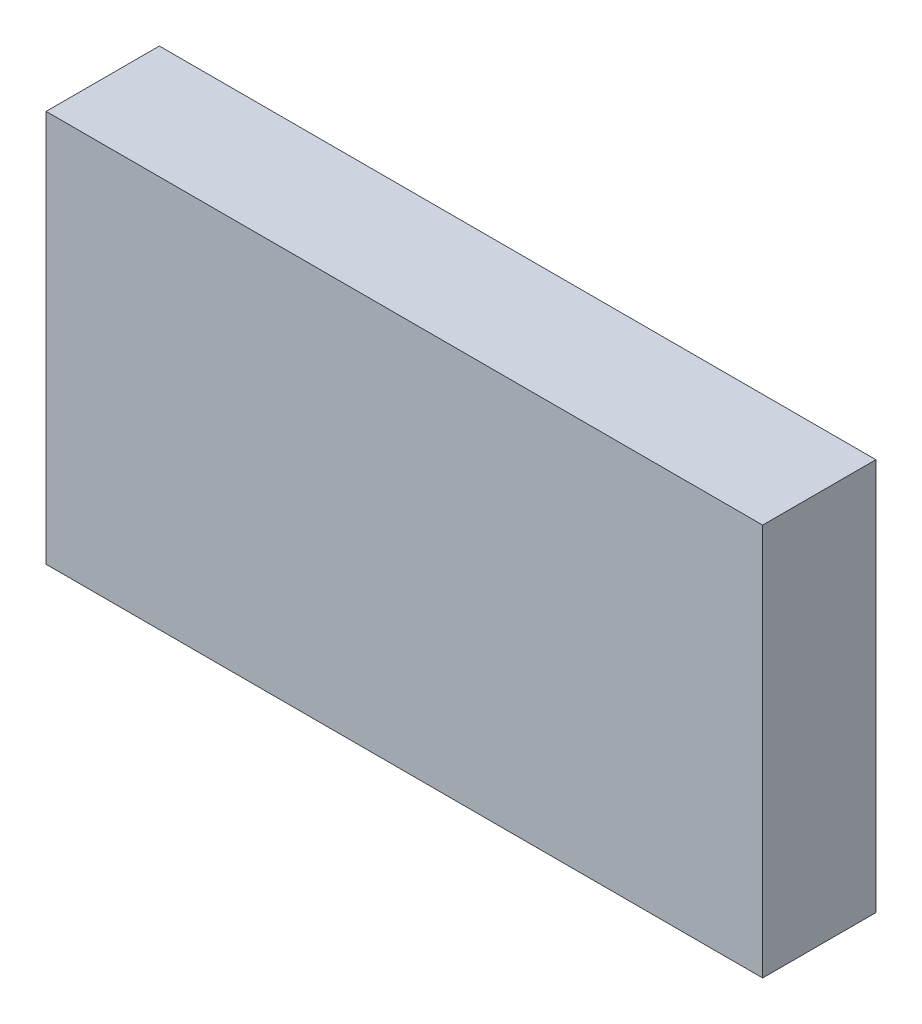
ISO-10303-21;
HEADER;
FILE_DESCRIPTION(('STEP AP214'),'2;1');
FILE_NAME('part.step','',(''),(''),'','','');
FILE_SCHEMA(('AUTOMOTIVE_DESIGN { 1 0 10303 214 1 1 1 1 }'));
ENDSEC;
DATA;
#1=APPLICATION_CONTEXT('core data for automotive mechanical design processes');
#2=APPLICATION_PROTOCOL_DEFINITION('international standard','automotive_design',2000,#1);
#3=PRODUCT_CONTEXT('',#1,'mechanical');
#4=PRODUCT('Part','Part','',(#3));
#5=PRODUCT_RELATED_PRODUCT_CATEGORY('part','',(#4));
#6=PRODUCT_DEFINITION_FORMATION('','',#4);
#7=PRODUCT_DEFINITION_CONTEXT('part definition',#1,'design');
#8=PRODUCT_DEFINITION('design','',#6,#7);
#9=PRODUCT_DEFINITION_SHAPE('','',#8);
#10=(LENGTH_UNIT() NAMED_UNIT(*) SI_UNIT(.MILLI.,.METRE.));
#11=(NAMED_UNIT(*) PLANE_ANGLE_UNIT() SI_UNIT($,.RADIAN.));
#12=(NAMED_UNIT(*) SI_UNIT($,.STERADIAN.) SOLID_ANGLE_UNIT());
#13=UNCERTAINTY_MEASURE_WITH_UNIT(LENGTH_MEASURE(1.E-05),#10,'distance_accuracy_value','');
#14=(GEOMETRIC_REPRESENTATION_CONTEXT(3) GLOBAL_UNCERTAINTY_ASSIGNED_CONTEXT((#13)) GLOBAL_UNIT_ASSIGNED_CONTEXT((#10,
#11,#12)) REPRESENTATION_CONTEXT('',''));
#15=CARTESIAN_POINT('',(0.,0.,0.));
#16=DIRECTION('',(0.,0.,1.));
#17=DIRECTION('',(1.,0.,0.));
#18=AXIS2_PLACEMENT_3D('',#15,#16,#17);
#19=CARTESIAN_POINT('',(-3.1635,-1.7,1.));
#20=DIRECTION('',(1.,0.,0.));
#21=DIRECTION('',(0.,0.,-1.));
#22=AXIS2_PLACEMENT_3D('',#19,#20,#21);
#23=PLANE('',#22);
#24=DIRECTION('',(0.,-1.,0.));
#25=VECTOR('',#24,1.);
#26=CARTESIAN_POINT('',(-3.1635,-1.7,0.));
#27=LINE('',#26,#25);
#28=CARTESIAN_POINT('',(-3.1635,1.7635,0.));
#29=VERTEX_POINT('',#28);
#30=CARTESIAN_POINT('',(-3.1635,-1.7,0.));
#31=VERTEX_POINT('',#30);
#32=EDGE_CURVE('E95',#29,#31,#27,.T.);
#33=ORIENTED_EDGE('',*,*,#32,.T.);
#34=DIRECTION('',(0.,0.,-1.));
#35=VECTOR('',#34,1.);
#36=CARTESIAN_POINT('',(-3.1635,-1.7,1.));
#37=LINE('',#36,#35);
#38=CARTESIAN_POINT('',(-3.1635,-1.7,1.));
#39=VERTEX_POINT('',#38);
#40=EDGE_CURVE('E11',#39,#31,#37,.T.);
#41=ORIENTED_EDGE('',*,*,#40,.F.);
#42=DIRECTION('',(0.,-1.,0.));
#43=VECTOR('',#42,1.);
#44=CARTESIAN_POINT('',(-3.1635,-1.7,1.));
#45=LINE('',#44,#43);
#46=CARTESIAN_POINT('',(-3.1635,1.7635,1.));
#47=VERTEX_POINT('',#46);
#48=EDGE_CURVE('E83',#47,#39,#45,.T.);
#49=ORIENTED_EDGE('',*,*,#48,.F.);
#50=DIRECTION('',(0.,0.,-1.));
#51=VECTOR('',#50,1.);
#52=CARTESIAN_POINT('',(-3.1635,1.7635,1.));
#53=LINE('',#52,#51);
#54=EDGE_CURVE('E91',#47,#29,#53,.T.);
#55=ORIENTED_EDGE('',*,*,#54,.T.);
#56=EDGE_LOOP('',(#33,#41,#49,#55));
#57=FACE_BOUND('',#56,.T.);
#58=ADVANCED_FACE('F32',(#57),#23,.F.);
#59=CARTESIAN_POINT('',(3.1635,-1.7,1.));
#60=DIRECTION('',(0.,1.,0.));
#61=DIRECTION('',(0.,0.,1.));
#62=AXIS2_PLACEMENT_3D('',#59,#60,#61);
#63=PLANE('',#62);
#64=DIRECTION('',(1.,0.,0.));
#65=VECTOR('',#64,1.);
#66=CARTESIAN_POINT('',(3.1635,-1.7,0.));
#67=LINE('',#66,#65);
#68=CARTESIAN_POINT('',(3.1635,-1.7,0.));
#69=VERTEX_POINT('',#68);
#70=EDGE_CURVE('E87',#31,#69,#67,.T.);
#71=ORIENTED_EDGE('',*,*,#70,.T.);
#72=DIRECTION('',(0.,0.,-1.));
#73=VECTOR('',#72,1.);
#74=CARTESIAN_POINT('',(3.1635,-1.7,1.));
#75=LINE('',#74,#73);
#76=CARTESIAN_POINT('',(3.1635,-1.7,1.));
#77=VERTEX_POINT('',#76);
#78=EDGE_CURVE('E40',#77,#69,#75,.T.);
#79=ORIENTED_EDGE('',*,*,#78,.F.);
#80=DIRECTION('',(1.,0.,0.));
#81=VECTOR('',#80,1.);
#82=CARTESIAN_POINT('',(3.1635,-1.7,1.));
#83=LINE('',#82,#81);
#84=EDGE_CURVE('E78',#39,#77,#83,.T.);
#85=ORIENTED_EDGE('',*,*,#84,.F.);
#86=ORIENTED_EDGE('',*,*,#40,.T.);
#87=EDGE_LOOP('',(#71,#79,#85,#86));
#88=FACE_BOUND('',#87,.T.);
#89=ADVANCED_FACE('F86',(#88),#63,.F.);
#90=CARTESIAN_POINT('',(3.1635,1.7635,1.));
#91=DIRECTION('',(-1.,0.,0.));
#92=DIRECTION('',(0.,0.,1.));
#93=AXIS2_PLACEMENT_3D('',#90,#91,#92);
#94=PLANE('',#93);
#95=DIRECTION('',(0.,1.,0.));
#96=VECTOR('',#95,1.);
#97=CARTESIAN_POINT('',(3.1635,1.7635,0.));
#98=LINE('',#97,#96);
#99=CARTESIAN_POINT('',(3.1635,1.7635,0.));
#100=VERTEX_POINT('',#99);
#101=EDGE_CURVE('E65',#69,#100,#98,.T.);
#102=ORIENTED_EDGE('',*,*,#101,.T.);
#103=DIRECTION('',(0.,0.,-1.));
#104=VECTOR('',#103,1.);
#105=CARTESIAN_POINT('',(3.1635,1.7635,1.));
#106=LINE('',#105,#104);
#107=CARTESIAN_POINT('',(3.1635,1.7635,1.));
#108=VERTEX_POINT('',#107);
#109=EDGE_CURVE('E88',#108,#100,#106,.T.);
#110=ORIENTED_EDGE('',*,*,#109,.F.);
#111=DIRECTION('',(0.,1.,0.));
#112=VECTOR('',#111,1.);
#113=CARTESIAN_POINT('',(3.1635,1.7635,1.));
#114=LINE('',#113,#112);
#115=EDGE_CURVE('E81',#77,#108,#114,.T.);
#116=ORIENTED_EDGE('',*,*,#115,.F.);
#117=ORIENTED_EDGE('',*,*,#78,.T.);
#118=EDGE_LOOP('',(#102,#110,#116,#117));
#119=FACE_BOUND('',#118,.T.);
#120=ADVANCED_FACE('F89',(#119),#94,.F.);
#121=CARTESIAN_POINT('',(-3.1635,1.7635,1.));
#122=DIRECTION('',(0.,-1.,0.));
#123=DIRECTION('',(0.,0.,-1.));
#124=AXIS2_PLACEMENT_3D('',#121,#122,#123);
#125=PLANE('',#124);
#126=DIRECTION('',(-1.,0.,0.));
#127=VECTOR('',#126,1.);
#128=CARTESIAN_POINT('',(-3.1635,1.7635,0.));
#129=LINE('',#128,#127);
#130=EDGE_CURVE('E71',#100,#29,#129,.T.);
#131=ORIENTED_EDGE('',*,*,#130,.T.);
#132=ORIENTED_EDGE('',*,*,#54,.F.);
#133=DIRECTION('',(-1.,0.,0.));
#134=VECTOR('',#133,1.);
#135=CARTESIAN_POINT('',(-3.1635,1.7635,1.));
#136=LINE('',#135,#134);
#137=EDGE_CURVE('E48',#108,#47,#136,.T.);
#138=ORIENTED_EDGE('',*,*,#137,.F.);
#139=ORIENTED_EDGE('',*,*,#109,.T.);
#140=EDGE_LOOP('',(#131,#132,#138,#139));
#141=FACE_BOUND('',#140,.T.);
#142=ADVANCED_FACE('F102',(#141),#125,.F.);
#143=CARTESIAN_POINT('',(0.,0.,1.));
#144=DIRECTION('',(0.,0.,-1.));
#145=DIRECTION('',(-1.,0.,0.));
#146=AXIS2_PLACEMENT_3D('',#143,#144,#145);
#147=PLANE('',#146);
#148=ORIENTED_EDGE('',*,*,#48,.T.);
#149=ORIENTED_EDGE('',*,*,#84,.T.);
#150=ORIENTED_EDGE('',*,*,#115,.T.);
#151=ORIENTED_EDGE('',*,*,#137,.T.);
#152=EDGE_LOOP('',(#148,#149,#150,#151));
#153=FACE_BOUND('',#152,.T.);
#154=ADVANCED_FACE('F79',(#153),#147,.F.);
#155=CARTESIAN_POINT('',(0.,0.,0.));
#156=DIRECTION('',(0.,0.,-1.));
#157=DIRECTION('',(-1.,0.,0.));
#158=AXIS2_PLACEMENT_3D('',#155,#156,#157);
#159=PLANE('',#158);
#160=ORIENTED_EDGE('',*,*,#32,.F.);
#161=ORIENTED_EDGE('',*,*,#130,.F.);
#162=ORIENTED_EDGE('',*,*,#101,.F.);
#163=ORIENTED_EDGE('',*,*,#70,.F.);
#164=EDGE_LOOP('',(#160,#161,#162,#163));
#165=FACE_BOUND('',#164,.T.);
#166=ADVANCED_FACE('F105',(#165),#159,.T.);
#167=CLOSED_SHELL('',(#58,#89,#120,#142,#154,#166));
#168=MANIFOLD_SOLID_BREP('B2',#167);
#169=ADVANCED_BREP_SHAPE_REPRESENTATION('',(#18,#168),#14);
#170=SHAPE_DEFINITION_REPRESENTATION(#9,#169);
ENDSEC;
END-ISO-10303-21;
